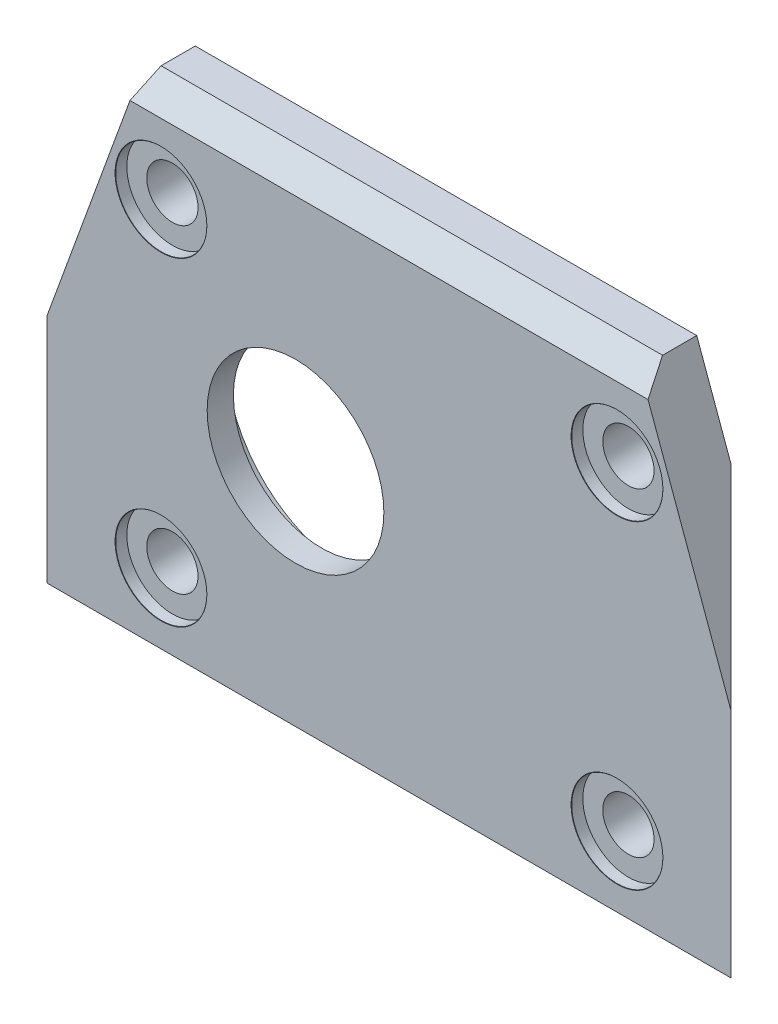
ISO-10303-21;
HEADER;
FILE_DESCRIPTION(('STEP AP214'),'2;1');
FILE_NAME('part.step','',(''),(''),'','','');
FILE_SCHEMA(('AUTOMOTIVE_DESIGN { 1 0 10303 214 1 1 1 1 }'));
ENDSEC;
DATA;
#1=APPLICATION_CONTEXT('core data for automotive mechanical design processes');
#2=APPLICATION_PROTOCOL_DEFINITION('international standard','automotive_design',2000,#1);
#3=PRODUCT_CONTEXT('',#1,'mechanical');
#4=PRODUCT('Part','Part','',(#3));
#5=PRODUCT_RELATED_PRODUCT_CATEGORY('part','',(#4));
#6=PRODUCT_DEFINITION_FORMATION('','',#4);
#7=PRODUCT_DEFINITION_CONTEXT('part definition',#1,'design');
#8=PRODUCT_DEFINITION('design','',#6,#7);
#9=PRODUCT_DEFINITION_SHAPE('','',#8);
#10=(LENGTH_UNIT() NAMED_UNIT(*) SI_UNIT(.MILLI.,.METRE.));
#11=(NAMED_UNIT(*) PLANE_ANGLE_UNIT() SI_UNIT($,.RADIAN.));
#12=(NAMED_UNIT(*) SI_UNIT($,.STERADIAN.) SOLID_ANGLE_UNIT());
#13=UNCERTAINTY_MEASURE_WITH_UNIT(LENGTH_MEASURE(1.E-05),#10,'distance_accuracy_value','');
#14=(GEOMETRIC_REPRESENTATION_CONTEXT(3) GLOBAL_UNCERTAINTY_ASSIGNED_CONTEXT((#13)) GLOBAL_UNIT_ASSIGNED_CONTEXT((#10,
#11,#12)) REPRESENTATION_CONTEXT('',''));
#15=CARTESIAN_POINT('',(0.,0.,0.));
#16=DIRECTION('',(0.,0.,1.));
#17=DIRECTION('',(1.,0.,0.));
#18=AXIS2_PLACEMENT_3D('',#15,#16,#17);
#19=CARTESIAN_POINT('',(-8.2,0.,5.));
#20=DIRECTION('',(0.,0.,-1.));
#21=DIRECTION('',(-1.,0.,0.));
#22=AXIS2_PLACEMENT_3D('',#19,#20,#21);
#23=CYLINDRICAL_SURFACE('',#22,7.75);
#24=CARTESIAN_POINT('',(-8.2,0.,5.));
#25=DIRECTION('',(0.,0.,1.));
#26=DIRECTION('',(1.,0.,0.));
#27=AXIS2_PLACEMENT_3D('',#24,#25,#26);
#28=CIRCLE('',#27,7.75);
#29=CARTESIAN_POINT('',(-0.450000000000001,0.,5.));
#30=VERTEX_POINT('',#29);
#31=EDGE_CURVE('E195',#30,#30,#28,.T.);
#32=ORIENTED_EDGE('',*,*,#31,.T.);
#33=EDGE_LOOP('',(#32));
#34=FACE_BOUND('',#33,.T.);
#35=CARTESIAN_POINT('',(-8.2,0.,2.7));
#36=DIRECTION('',(0.,0.,-1.));
#37=DIRECTION('',(-1.,0.,0.));
#38=AXIS2_PLACEMENT_3D('',#35,#36,#37);
#39=CIRCLE('',#38,7.75);
#40=CARTESIAN_POINT('',(-15.95,0.,2.7));
#41=VERTEX_POINT('',#40);
#42=EDGE_CURVE('E134',#41,#41,#39,.T.);
#43=ORIENTED_EDGE('',*,*,#42,.T.);
#44=EDGE_LOOP('',(#43));
#45=FACE_BOUND('',#44,.T.);
#46=ADVANCED_FACE('F37',(#34,#45),#23,.F.);
#47=CARTESIAN_POINT('',(-20.,14.,5.));
#48=DIRECTION('',(0.,0.,-1.));
#49=DIRECTION('',(-1.,0.,0.));
#50=AXIS2_PLACEMENT_3D('',#47,#48,#49);
#51=CYLINDRICAL_SURFACE('',#50,2.25);
#52=CARTESIAN_POINT('',(-20.,14.,0.));
#53=DIRECTION('',(0.,0.,1.));
#54=DIRECTION('',(1.,0.,0.));
#55=AXIS2_PLACEMENT_3D('',#52,#53,#54);
#56=CIRCLE('',#55,2.25);
#57=CARTESIAN_POINT('',(-17.75,14.,0.));
#58=VERTEX_POINT('',#57);
#59=EDGE_CURVE('E122',#58,#58,#56,.T.);
#60=ORIENTED_EDGE('',*,*,#59,.F.);
#61=EDGE_LOOP('',(#60));
#62=FACE_BOUND('',#61,.T.);
#63=CARTESIAN_POINT('',(-20.,14.,4.));
#64=DIRECTION('',(0.,0.,1.));
#65=DIRECTION('',(1.,0.,0.));
#66=AXIS2_PLACEMENT_3D('',#63,#64,#65);
#67=CIRCLE('',#66,2.25);
#68=CARTESIAN_POINT('',(-17.75,14.,4.));
#69=VERTEX_POINT('',#68);
#70=EDGE_CURVE('E234',#69,#69,#67,.T.);
#71=ORIENTED_EDGE('',*,*,#70,.T.);
#72=EDGE_LOOP('',(#71));
#73=FACE_BOUND('',#72,.T.);
#74=ADVANCED_FACE('F285',(#62,#73),#51,.F.);
#75=CARTESIAN_POINT('',(20.,14.,5.));
#76=DIRECTION('',(0.,0.,-1.));
#77=DIRECTION('',(-1.,0.,0.));
#78=AXIS2_PLACEMENT_3D('',#75,#76,#77);
#79=CYLINDRICAL_SURFACE('',#78,2.25);
#80=CARTESIAN_POINT('',(20.,14.,0.));
#81=DIRECTION('',(0.,0.,1.));
#82=DIRECTION('',(1.,0.,0.));
#83=AXIS2_PLACEMENT_3D('',#80,#81,#82);
#84=CIRCLE('',#83,2.25);
#85=CARTESIAN_POINT('',(22.25,14.,0.));
#86=VERTEX_POINT('',#85);
#87=EDGE_CURVE('E189',#86,#86,#84,.T.);
#88=ORIENTED_EDGE('',*,*,#87,.F.);
#89=EDGE_LOOP('',(#88));
#90=FACE_BOUND('',#89,.T.);
#91=CARTESIAN_POINT('',(20.,14.,4.));
#92=DIRECTION('',(0.,0.,1.));
#93=DIRECTION('',(1.,0.,0.));
#94=AXIS2_PLACEMENT_3D('',#91,#92,#93);
#95=CIRCLE('',#94,2.25);
#96=CARTESIAN_POINT('',(22.25,14.,4.));
#97=VERTEX_POINT('',#96);
#98=EDGE_CURVE('E222',#97,#97,#95,.T.);
#99=ORIENTED_EDGE('',*,*,#98,.T.);
#100=EDGE_LOOP('',(#99));
#101=FACE_BOUND('',#100,.T.);
#102=ADVANCED_FACE('F291',(#90,#101),#79,.F.);
#103=CARTESIAN_POINT('',(20.,-14.,5.));
#104=DIRECTION('',(0.,0.,-1.));
#105=DIRECTION('',(-1.,0.,0.));
#106=AXIS2_PLACEMENT_3D('',#103,#104,#105);
#107=CYLINDRICAL_SURFACE('',#106,2.25);
#108=CARTESIAN_POINT('',(20.,-14.,0.));
#109=DIRECTION('',(0.,0.,1.));
#110=DIRECTION('',(1.,0.,0.));
#111=AXIS2_PLACEMENT_3D('',#108,#109,#110);
#112=CIRCLE('',#111,2.25);
#113=CARTESIAN_POINT('',(22.25,-14.,0.));
#114=VERTEX_POINT('',#113);
#115=EDGE_CURVE('E192',#114,#114,#112,.T.);
#116=ORIENTED_EDGE('',*,*,#115,.F.);
#117=EDGE_LOOP('',(#116));
#118=FACE_BOUND('',#117,.T.);
#119=CARTESIAN_POINT('',(20.,-14.,4.));
#120=DIRECTION('',(0.,0.,1.));
#121=DIRECTION('',(1.,0.,0.));
#122=AXIS2_PLACEMENT_3D('',#119,#120,#121);
#123=CIRCLE('',#122,2.25);
#124=CARTESIAN_POINT('',(22.25,-14.,4.));
#125=VERTEX_POINT('',#124);
#126=EDGE_CURVE('E210',#125,#125,#123,.T.);
#127=ORIENTED_EDGE('',*,*,#126,.T.);
#128=EDGE_LOOP('',(#127));
#129=FACE_BOUND('',#128,.T.);
#130=ADVANCED_FACE('F296',(#118,#129),#107,.F.);
#131=CARTESIAN_POINT('',(0.,0.,5.));
#132=DIRECTION('',(0.,0.,-1.));
#133=DIRECTION('',(-1.,0.,0.));
#134=AXIS2_PLACEMENT_3D('',#131,#132,#133);
#135=PLANE('',#134);
#136=CARTESIAN_POINT('',(-20.,14.,5.));
#137=DIRECTION('',(0.,0.,1.));
#138=DIRECTION('',(1.,0.,0.));
#139=AXIS2_PLACEMENT_3D('',#136,#137,#138);
#140=CIRCLE('',#139,4.025);
#141=CARTESIAN_POINT('',(-15.975,14.,5.));
#142=VERTEX_POINT('',#141);
#143=EDGE_CURVE('E137',#142,#142,#140,.T.);
#144=ORIENTED_EDGE('',*,*,#143,.F.);
#145=EDGE_LOOP('',(#144));
#146=FACE_BOUND('',#145,.T.);
#147=CARTESIAN_POINT('',(20.,14.,5.));
#148=DIRECTION('',(0.,0.,1.));
#149=DIRECTION('',(1.,0.,0.));
#150=AXIS2_PLACEMENT_3D('',#147,#148,#149);
#151=CIRCLE('',#150,4.025);
#152=CARTESIAN_POINT('',(24.025,14.,5.));
#153=VERTEX_POINT('',#152);
#154=EDGE_CURVE('E231',#153,#153,#151,.T.);
#155=ORIENTED_EDGE('',*,*,#154,.F.);
#156=EDGE_LOOP('',(#155));
#157=FACE_BOUND('',#156,.T.);
#158=ORIENTED_EDGE('',*,*,#31,.F.);
#159=EDGE_LOOP('',(#158));
#160=FACE_BOUND('',#159,.T.);
#161=DIRECTION('',(0.,-1.,0.));
#162=VECTOR('',#161,1.);
#163=CARTESIAN_POINT('',(-30.,-22.15,5.));
#164=LINE('',#163,#162);
#165=CARTESIAN_POINT('',(-30.,0.149999999999786,5.));
#166=VERTEX_POINT('',#165);
#167=CARTESIAN_POINT('',(-30.,-20.15,5.));
#168=VERTEX_POINT('',#167);
#169=EDGE_CURVE('E131',#166,#168,#164,.T.);
#170=ORIENTED_EDGE('',*,*,#169,.T.);
#171=DIRECTION('',(1.,0.,0.));
#172=VECTOR('',#171,1.);
#173=CARTESIAN_POINT('',(0.,-20.15,5.));
#174=LINE('',#173,#172);
#175=CARTESIAN_POINT('',(30.,-20.15,5.));
#176=VERTEX_POINT('',#175);
#177=EDGE_CURVE('E149',#168,#176,#174,.T.);
#178=ORIENTED_EDGE('',*,*,#177,.T.);
#179=DIRECTION('',(0.,1.,0.));
#180=VECTOR('',#179,1.);
#181=CARTESIAN_POINT('',(30.,-22.15,5.));
#182=LINE('',#181,#180);
#183=CARTESIAN_POINT('',(30.,0.149999999999786,5.));
#184=VERTEX_POINT('',#183);
#185=EDGE_CURVE('E125',#176,#184,#182,.T.);
#186=ORIENTED_EDGE('',*,*,#185,.T.);
#187=DIRECTION('',(0.342020143325666,-0.939692620785909,0.));
#188=VECTOR('',#187,1.);
#189=CARTESIAN_POINT('',(21.9926548461435,22.15,5.));
#190=LINE('',#189,#188);
#191=CARTESIAN_POINT('',(22.7205953146759,20.15,5.));
#192=VERTEX_POINT('',#191);
#193=EDGE_CURVE('E143',#184,#192,#190,.F.);
#194=ORIENTED_EDGE('',*,*,#193,.T.);
#195=DIRECTION('',(-1.,0.,0.));
#196=VECTOR('',#195,1.);
#197=CARTESIAN_POINT('',(0.,20.15,5.));
#198=LINE('',#197,#196);
#199=CARTESIAN_POINT('',(-22.7205953146759,20.15,5.));
#200=VERTEX_POINT('',#199);
#201=EDGE_CURVE('E146',#192,#200,#198,.T.);
#202=ORIENTED_EDGE('',*,*,#201,.T.);
#203=DIRECTION('',(0.342020143325667,0.939692620785909,0.));
#204=VECTOR('',#203,1.);
#205=CARTESIAN_POINT('',(-30.,0.149999999999786,5.));
#206=LINE('',#205,#204);
#207=EDGE_CURVE('E117',#200,#166,#206,.F.);
#208=ORIENTED_EDGE('',*,*,#207,.T.);
#209=EDGE_LOOP('',(#170,#178,#186,#194,#202,#208));
#210=FACE_BOUND('',#209,.T.);
#211=CARTESIAN_POINT('',(-20.,-14.,5.));
#212=DIRECTION('',(0.,0.,1.));
#213=DIRECTION('',(1.,0.,0.));
#214=AXIS2_PLACEMENT_3D('',#211,#212,#213);
#215=CIRCLE('',#214,4.025);
#216=CARTESIAN_POINT('',(-15.975,-14.,5.));
#217=VERTEX_POINT('',#216);
#218=EDGE_CURVE('E207',#217,#217,#215,.T.);
#219=ORIENTED_EDGE('',*,*,#218,.F.);
#220=EDGE_LOOP('',(#219));
#221=FACE_BOUND('',#220,.T.);
#222=CARTESIAN_POINT('',(20.,-14.,5.));
#223=DIRECTION('',(0.,0.,1.));
#224=DIRECTION('',(1.,0.,0.));
#225=AXIS2_PLACEMENT_3D('',#222,#223,#224);
#226=CIRCLE('',#225,4.025);
#227=CARTESIAN_POINT('',(24.025,-14.,5.));
#228=VERTEX_POINT('',#227);
#229=EDGE_CURVE('E219',#228,#228,#226,.T.);
#230=ORIENTED_EDGE('',*,*,#229,.F.);
#231=EDGE_LOOP('',(#230));
#232=FACE_BOUND('',#231,.T.);
#233=ADVANCED_FACE('F178',(#146,#157,#160,#210,#221,#232),#135,.F.);
#234=CARTESIAN_POINT('',(0.,0.,0.));
#235=DIRECTION('',(0.,0.,-1.));
#236=DIRECTION('',(-1.,0.,0.));
#237=AXIS2_PLACEMENT_3D('',#234,#235,#236);
#238=PLANE('',#237);
#239=CARTESIAN_POINT('',(-8.2,0.,0.));
#240=DIRECTION('',(0.,0.,-1.));
#241=DIRECTION('',(-1.,0.,0.));
#242=AXIS2_PLACEMENT_3D('',#239,#240,#241);
#243=CIRCLE('',#242,11.1);
#244=CARTESIAN_POINT('',(-19.3,0.,0.));
#245=VERTEX_POINT('',#244);
#246=EDGE_CURVE('E245',#245,#245,#243,.T.);
#247=ORIENTED_EDGE('',*,*,#246,.F.);
#248=EDGE_LOOP('',(#247));
#249=FACE_BOUND('',#248,.T.);
#250=ORIENTED_EDGE('',*,*,#115,.T.);
#251=EDGE_LOOP('',(#250));
#252=FACE_BOUND('',#251,.T.);
#253=CARTESIAN_POINT('',(-20.,-14.,0.));
#254=DIRECTION('',(0.,0.,1.));
#255=DIRECTION('',(1.,0.,0.));
#256=AXIS2_PLACEMENT_3D('',#253,#254,#255);
#257=CIRCLE('',#256,2.25);
#258=CARTESIAN_POINT('',(-17.75,-14.,0.));
#259=VERTEX_POINT('',#258);
#260=EDGE_CURVE('E128',#259,#259,#257,.T.);
#261=ORIENTED_EDGE('',*,*,#260,.T.);
#262=EDGE_LOOP('',(#261));
#263=FACE_BOUND('',#262,.T.);
#264=DIRECTION('',(1.,0.,0.));
#265=VECTOR('',#264,1.);
#266=CARTESIAN_POINT('',(-30.,-22.15,0.));
#267=LINE('',#266,#265);
#268=CARTESIAN_POINT('',(-25.,-22.15,0.));
#269=VERTEX_POINT('',#268);
#270=CARTESIAN_POINT('',(25.,-22.15,0.));
#271=VERTEX_POINT('',#270);
#272=EDGE_CURVE('E121',#269,#271,#267,.T.);
#273=ORIENTED_EDGE('',*,*,#272,.F.);
#274=DIRECTION('',(0.,1.,0.));
#275=VECTOR('',#274,1.);
#276=CARTESIAN_POINT('',(-25.,0.149999999999786,0.));
#277=LINE('',#276,#275);
#278=CARTESIAN_POINT('',(-25.,13.887387097273,0.));
#279=VERTEX_POINT('',#278);
#280=EDGE_CURVE('E52',#269,#279,#277,.T.);
#281=ORIENTED_EDGE('',*,*,#280,.T.);
#282=DIRECTION('',(-0.342020143325667,-0.939692620785909,0.));
#283=VECTOR('',#282,1.);
#284=CARTESIAN_POINT('',(-26.5388757175111,9.65936081206409,0.));
#285=LINE('',#284,#283);
#286=CARTESIAN_POINT('',(-21.9926548461435,22.15,0.));
#287=VERTEX_POINT('',#286);
#288=EDGE_CURVE('E111',#279,#287,#285,.F.);
#289=ORIENTED_EDGE('',*,*,#288,.T.);
#290=DIRECTION('',(-1.,0.,0.));
#291=VECTOR('',#290,1.);
#292=CARTESIAN_POINT('',(-30.,22.15,0.));
#293=LINE('',#292,#291);
#294=CARTESIAN_POINT('',(21.9926548461435,22.15,0.));
#295=VERTEX_POINT('',#294);
#296=EDGE_CURVE('E106',#295,#287,#293,.T.);
#297=ORIENTED_EDGE('',*,*,#296,.F.);
#298=DIRECTION('',(-0.342020143325666,0.939692620785909,0.));
#299=VECTOR('',#298,1.);
#300=CARTESIAN_POINT('',(26.5388757175111,9.65936081206408,0.));
#301=LINE('',#300,#299);
#302=CARTESIAN_POINT('',(25.,13.887387097273,0.));
#303=VERTEX_POINT('',#302);
#304=EDGE_CURVE('E114',#295,#303,#301,.F.);
#305=ORIENTED_EDGE('',*,*,#304,.T.);
#306=DIRECTION('',(0.,-1.,0.));
#307=VECTOR('',#306,1.);
#308=CARTESIAN_POINT('',(25.,-22.15,0.));
#309=LINE('',#308,#307);
#310=EDGE_CURVE('E168',#303,#271,#309,.T.);
#311=ORIENTED_EDGE('',*,*,#310,.T.);
#312=EDGE_LOOP('',(#273,#281,#289,#297,#305,#311));
#313=FACE_BOUND('',#312,.T.);
#314=ORIENTED_EDGE('',*,*,#59,.T.);
#315=EDGE_LOOP('',(#314));
#316=FACE_BOUND('',#315,.T.);
#317=ORIENTED_EDGE('',*,*,#87,.T.);
#318=EDGE_LOOP('',(#317));
#319=FACE_BOUND('',#318,.T.);
#320=ADVANCED_FACE('F119',(#249,#252,#263,#313,#316,#319),#238,.T.);
#321=CARTESIAN_POINT('',(-30.,22.15,5.));
#322=DIRECTION('',(0.,-1.,0.));
#323=DIRECTION('',(0.,0.,-1.));
#324=AXIS2_PLACEMENT_3D('',#321,#322,#323);
#325=PLANE('',#324);
#326=DIRECTION('',(0.,0.,1.));
#327=VECTOR('',#326,1.);
#328=CARTESIAN_POINT('',(-21.9926548461435,22.15,5.));
#329=LINE('',#328,#327);
#330=CARTESIAN_POINT('',(-21.9926548461435,22.15,2.99999999999999));
#331=VERTEX_POINT('',#330);
#332=EDGE_CURVE('E112',#287,#331,#329,.T.);
#333=ORIENTED_EDGE('',*,*,#332,.T.);
#334=DIRECTION('',(1.,0.,0.));
#335=VECTOR('',#334,1.);
#336=CARTESIAN_POINT('',(-30.,22.15,2.99999999999999));
#337=LINE('',#336,#335);
#338=CARTESIAN_POINT('',(21.9926548461435,22.15,2.99999999999999));
#339=VERTEX_POINT('',#338);
#340=EDGE_CURVE('E109',#331,#339,#337,.T.);
#341=ORIENTED_EDGE('',*,*,#340,.T.);
#342=DIRECTION('',(0.,0.,-1.));
#343=VECTOR('',#342,1.);
#344=CARTESIAN_POINT('',(21.9926548461435,22.15,5.));
#345=LINE('',#344,#343);
#346=EDGE_CURVE('E102',#339,#295,#345,.T.);
#347=ORIENTED_EDGE('',*,*,#346,.T.);
#348=ORIENTED_EDGE('',*,*,#296,.T.);
#349=EDGE_LOOP('',(#333,#341,#347,#348));
#350=FACE_BOUND('',#349,.T.);
#351=ADVANCED_FACE('F104',(#350),#325,.F.);
#352=CARTESIAN_POINT('',(-30.,-22.15,5.));
#353=DIRECTION('',(0.,1.,0.));
#354=DIRECTION('',(0.,0.,1.));
#355=AXIS2_PLACEMENT_3D('',#352,#353,#354);
#356=PLANE('',#355);
#357=DIRECTION('',(-1.,0.,0.));
#358=VECTOR('',#357,1.);
#359=CARTESIAN_POINT('',(-30.,-22.15,2.99999999999999));
#360=LINE('',#359,#358);
#361=CARTESIAN_POINT('',(28.,-22.15,2.99999999999999));
#362=VERTEX_POINT('',#361);
#363=CARTESIAN_POINT('',(-28.,-22.15,2.99999999999999));
#364=VERTEX_POINT('',#363);
#365=EDGE_CURVE('E152',#362,#364,#360,.T.);
#366=ORIENTED_EDGE('',*,*,#365,.T.);
#367=DIRECTION('',(0.707106781186548,0.,-0.707106781186547));
#368=VECTOR('',#367,1.);
#369=CARTESIAN_POINT('',(-30.,-22.15,5.));
#370=LINE('',#369,#368);
#371=EDGE_CURVE('E166',#364,#269,#370,.T.);
#372=ORIENTED_EDGE('',*,*,#371,.T.);
#373=ORIENTED_EDGE('',*,*,#272,.T.);
#374=DIRECTION('',(0.707106781186548,0.,0.707106781186547));
#375=VECTOR('',#374,1.);
#376=CARTESIAN_POINT('',(30.,-22.15,5.));
#377=LINE('',#376,#375);
#378=EDGE_CURVE('E164',#271,#362,#377,.T.);
#379=ORIENTED_EDGE('',*,*,#378,.T.);
#380=EDGE_LOOP('',(#366,#372,#373,#379));
#381=FACE_BOUND('',#380,.T.);
#382=ADVANCED_FACE('F270',(#381),#356,.F.);
#383=CARTESIAN_POINT('',(-20.,-14.,5.));
#384=DIRECTION('',(0.,0.,-1.));
#385=DIRECTION('',(-1.,0.,0.));
#386=AXIS2_PLACEMENT_3D('',#383,#384,#385);
#387=CYLINDRICAL_SURFACE('',#386,2.25);
#388=CARTESIAN_POINT('',(-20.,-14.,4.));
#389=DIRECTION('',(0.,0.,1.));
#390=DIRECTION('',(1.,0.,0.));
#391=AXIS2_PLACEMENT_3D('',#388,#389,#390);
#392=CIRCLE('',#391,2.25);
#393=CARTESIAN_POINT('',(-17.75,-14.,4.));
#394=VERTEX_POINT('',#393);
#395=EDGE_CURVE('E198',#394,#394,#392,.T.);
#396=ORIENTED_EDGE('',*,*,#395,.T.);
#397=EDGE_LOOP('',(#396));
#398=FACE_BOUND('',#397,.T.);
#399=ORIENTED_EDGE('',*,*,#260,.F.);
#400=EDGE_LOOP('',(#399));
#401=FACE_BOUND('',#400,.T.);
#402=ADVANCED_FACE('F267',(#398,#401),#387,.F.);
#403=CARTESIAN_POINT('',(-16.,-14.,4.));
#404=DIRECTION('',(0.,0.,-1.));
#405=DIRECTION('',(-1.,0.,0.));
#406=AXIS2_PLACEMENT_3D('',#403,#404,#405);
#407=PLANE('',#406);
#408=ORIENTED_EDGE('',*,*,#395,.F.);
#409=EDGE_LOOP('',(#408));
#410=FACE_BOUND('',#409,.T.);
#411=CARTESIAN_POINT('',(-20.,-14.,4.));
#412=DIRECTION('',(0.,0.,1.));
#413=DIRECTION('',(1.,0.,0.));
#414=AXIS2_PLACEMENT_3D('',#411,#412,#413);
#415=CIRCLE('',#414,4.);
#416=CARTESIAN_POINT('',(-16.,-14.,4.));
#417=VERTEX_POINT('',#416);
#418=EDGE_CURVE('E201',#417,#417,#415,.T.);
#419=ORIENTED_EDGE('',*,*,#418,.T.);
#420=EDGE_LOOP('',(#419));
#421=FACE_BOUND('',#420,.T.);
#422=ADVANCED_FACE('F269',(#410,#421),#407,.F.);
#423=CARTESIAN_POINT('',(-20.,-14.,5.));
#424=DIRECTION('',(0.,0.,1.));
#425=DIRECTION('',(1.,0.,0.));
#426=AXIS2_PLACEMENT_3D('',#423,#424,#425);
#427=CYLINDRICAL_SURFACE('',#426,4.);
#428=ORIENTED_EDGE('',*,*,#418,.F.);
#429=EDGE_LOOP('',(#428));
#430=FACE_BOUND('',#429,.T.);
#431=CARTESIAN_POINT('',(-20.,-14.,4.975));
#432=DIRECTION('',(0.,0.,1.));
#433=DIRECTION('',(1.,0.,0.));
#434=AXIS2_PLACEMENT_3D('',#431,#432,#433);
#435=CIRCLE('',#434,4.);
#436=CARTESIAN_POINT('',(-16.,-14.,4.975));
#437=VERTEX_POINT('',#436);
#438=EDGE_CURVE('E204',#437,#437,#435,.T.);
#439=ORIENTED_EDGE('',*,*,#438,.T.);
#440=EDGE_LOOP('',(#439));
#441=FACE_BOUND('',#440,.T.);
#442=ADVANCED_FACE('F277',(#430,#441),#427,.F.);
#443=CARTESIAN_POINT('',(-20.,-14.,5.));
#444=DIRECTION('',(0.,0.,1.));
#445=DIRECTION('',(1.,0.,0.));
#446=AXIS2_PLACEMENT_3D('',#443,#444,#445);
#447=CONICAL_SURFACE('',#446,4.025,0.785398163397431);
#448=ORIENTED_EDGE('',*,*,#438,.F.);
#449=EDGE_LOOP('',(#448));
#450=FACE_BOUND('',#449,.T.);
#451=ORIENTED_EDGE('',*,*,#218,.T.);
#452=EDGE_LOOP('',(#451));
#453=FACE_BOUND('',#452,.T.);
#454=ADVANCED_FACE('F505',(#450,#453),#447,.F.);
#455=CARTESIAN_POINT('',(24.,-14.,4.));
#456=DIRECTION('',(0.,0.,-1.));
#457=DIRECTION('',(-1.,0.,0.));
#458=AXIS2_PLACEMENT_3D('',#455,#456,#457);
#459=PLANE('',#458);
#460=ORIENTED_EDGE('',*,*,#126,.F.);
#461=EDGE_LOOP('',(#460));
#462=FACE_BOUND('',#461,.T.);
#463=CARTESIAN_POINT('',(20.,-14.,4.));
#464=DIRECTION('',(0.,0.,1.));
#465=DIRECTION('',(1.,0.,0.));
#466=AXIS2_PLACEMENT_3D('',#463,#464,#465);
#467=CIRCLE('',#466,4.);
#468=CARTESIAN_POINT('',(24.,-14.,4.));
#469=VERTEX_POINT('',#468);
#470=EDGE_CURVE('E213',#469,#469,#467,.T.);
#471=ORIENTED_EDGE('',*,*,#470,.T.);
#472=EDGE_LOOP('',(#471));
#473=FACE_BOUND('',#472,.T.);
#474=ADVANCED_FACE('F495',(#462,#473),#459,.F.);
#475=CARTESIAN_POINT('',(20.,-14.,5.));
#476=DIRECTION('',(0.,0.,1.));
#477=DIRECTION('',(1.,0.,0.));
#478=AXIS2_PLACEMENT_3D('',#475,#476,#477);
#479=CYLINDRICAL_SURFACE('',#478,4.);
#480=ORIENTED_EDGE('',*,*,#470,.F.);
#481=EDGE_LOOP('',(#480));
#482=FACE_BOUND('',#481,.T.);
#483=CARTESIAN_POINT('',(20.,-14.,4.975));
#484=DIRECTION('',(0.,0.,1.));
#485=DIRECTION('',(1.,0.,0.));
#486=AXIS2_PLACEMENT_3D('',#483,#484,#485);
#487=CIRCLE('',#486,4.);
#488=CARTESIAN_POINT('',(24.,-14.,4.975));
#489=VERTEX_POINT('',#488);
#490=EDGE_CURVE('E216',#489,#489,#487,.T.);
#491=ORIENTED_EDGE('',*,*,#490,.T.);
#492=EDGE_LOOP('',(#491));
#493=FACE_BOUND('',#492,.T.);
#494=ADVANCED_FACE('F485',(#482,#493),#479,.F.);
#495=CARTESIAN_POINT('',(20.,-14.,5.));
#496=DIRECTION('',(0.,0.,1.));
#497=DIRECTION('',(1.,0.,0.));
#498=AXIS2_PLACEMENT_3D('',#495,#496,#497);
#499=CONICAL_SURFACE('',#498,4.025,0.785398163397431);
#500=ORIENTED_EDGE('',*,*,#490,.F.);
#501=EDGE_LOOP('',(#500));
#502=FACE_BOUND('',#501,.T.);
#503=ORIENTED_EDGE('',*,*,#229,.T.);
#504=EDGE_LOOP('',(#503));
#505=FACE_BOUND('',#504,.T.);
#506=ADVANCED_FACE('F311',(#502,#505),#499,.F.);
#507=CARTESIAN_POINT('',(24.,14.,4.));
#508=DIRECTION('',(0.,0.,-1.));
#509=DIRECTION('',(-1.,0.,0.));
#510=AXIS2_PLACEMENT_3D('',#507,#508,#509);
#511=PLANE('',#510);
#512=ORIENTED_EDGE('',*,*,#98,.F.);
#513=EDGE_LOOP('',(#512));
#514=FACE_BOUND('',#513,.T.);
#515=CARTESIAN_POINT('',(20.,14.,4.));
#516=DIRECTION('',(0.,0.,1.));
#517=DIRECTION('',(1.,0.,0.));
#518=AXIS2_PLACEMENT_3D('',#515,#516,#517);
#519=CIRCLE('',#518,4.);
#520=CARTESIAN_POINT('',(24.,14.,4.));
#521=VERTEX_POINT('',#520);
#522=EDGE_CURVE('E225',#521,#521,#519,.T.);
#523=ORIENTED_EDGE('',*,*,#522,.T.);
#524=EDGE_LOOP('',(#523));
#525=FACE_BOUND('',#524,.T.);
#526=ADVANCED_FACE('F307',(#514,#525),#511,.F.);
#527=CARTESIAN_POINT('',(20.,14.,5.));
#528=DIRECTION('',(0.,0.,1.));
#529=DIRECTION('',(1.,0.,0.));
#530=AXIS2_PLACEMENT_3D('',#527,#528,#529);
#531=CYLINDRICAL_SURFACE('',#530,4.);
#532=ORIENTED_EDGE('',*,*,#522,.F.);
#533=EDGE_LOOP('',(#532));
#534=FACE_BOUND('',#533,.T.);
#535=CARTESIAN_POINT('',(20.,14.,4.975));
#536=DIRECTION('',(0.,0.,1.));
#537=DIRECTION('',(1.,0.,0.));
#538=AXIS2_PLACEMENT_3D('',#535,#536,#537);
#539=CIRCLE('',#538,4.);
#540=CARTESIAN_POINT('',(24.,14.,4.975));
#541=VERTEX_POINT('',#540);
#542=EDGE_CURVE('E228',#541,#541,#539,.T.);
#543=ORIENTED_EDGE('',*,*,#542,.T.);
#544=EDGE_LOOP('',(#543));
#545=FACE_BOUND('',#544,.T.);
#546=ADVANCED_FACE('F310',(#534,#545),#531,.F.);
#547=CARTESIAN_POINT('',(20.,14.,5.));
#548=DIRECTION('',(0.,0.,1.));
#549=DIRECTION('',(1.,0.,0.));
#550=AXIS2_PLACEMENT_3D('',#547,#548,#549);
#551=CONICAL_SURFACE('',#550,4.025,0.785398163397431);
#552=ORIENTED_EDGE('',*,*,#542,.F.);
#553=EDGE_LOOP('',(#552));
#554=FACE_BOUND('',#553,.T.);
#555=ORIENTED_EDGE('',*,*,#154,.T.);
#556=EDGE_LOOP('',(#555));
#557=FACE_BOUND('',#556,.T.);
#558=ADVANCED_FACE('F317',(#554,#557),#551,.F.);
#559=CARTESIAN_POINT('',(-16.,14.,4.));
#560=DIRECTION('',(0.,0.,-1.));
#561=DIRECTION('',(-1.,0.,0.));
#562=AXIS2_PLACEMENT_3D('',#559,#560,#561);
#563=PLANE('',#562);
#564=ORIENTED_EDGE('',*,*,#70,.F.);
#565=EDGE_LOOP('',(#564));
#566=FACE_BOUND('',#565,.T.);
#567=CARTESIAN_POINT('',(-20.,14.,4.));
#568=DIRECTION('',(0.,0.,1.));
#569=DIRECTION('',(1.,0.,0.));
#570=AXIS2_PLACEMENT_3D('',#567,#568,#569);
#571=CIRCLE('',#570,4.);
#572=CARTESIAN_POINT('',(-16.,14.,4.));
#573=VERTEX_POINT('',#572);
#574=EDGE_CURVE('E237',#573,#573,#571,.T.);
#575=ORIENTED_EDGE('',*,*,#574,.T.);
#576=EDGE_LOOP('',(#575));
#577=FACE_BOUND('',#576,.T.);
#578=ADVANCED_FACE('F323',(#566,#577),#563,.F.);
#579=CARTESIAN_POINT('',(-20.,14.,5.));
#580=DIRECTION('',(0.,0.,1.));
#581=DIRECTION('',(1.,0.,0.));
#582=AXIS2_PLACEMENT_3D('',#579,#580,#581);
#583=CYLINDRICAL_SURFACE('',#582,4.);
#584=ORIENTED_EDGE('',*,*,#574,.F.);
#585=EDGE_LOOP('',(#584));
#586=FACE_BOUND('',#585,.T.);
#587=CARTESIAN_POINT('',(-20.,14.,4.975));
#588=DIRECTION('',(0.,0.,1.));
#589=DIRECTION('',(1.,0.,0.));
#590=AXIS2_PLACEMENT_3D('',#587,#588,#589);
#591=CIRCLE('',#590,4.);
#592=CARTESIAN_POINT('',(-16.,14.,4.975));
#593=VERTEX_POINT('',#592);
#594=EDGE_CURVE('E240',#593,#593,#591,.T.);
#595=ORIENTED_EDGE('',*,*,#594,.T.);
#596=EDGE_LOOP('',(#595));
#597=FACE_BOUND('',#596,.T.);
#598=ADVANCED_FACE('F439',(#586,#597),#583,.F.);
#599=CARTESIAN_POINT('',(-20.,14.,5.));
#600=DIRECTION('',(0.,0.,1.));
#601=DIRECTION('',(1.,0.,0.));
#602=AXIS2_PLACEMENT_3D('',#599,#600,#601);
#603=CONICAL_SURFACE('',#602,4.025,0.785398163397431);
#604=ORIENTED_EDGE('',*,*,#594,.F.);
#605=EDGE_LOOP('',(#604));
#606=FACE_BOUND('',#605,.T.);
#607=ORIENTED_EDGE('',*,*,#143,.T.);
#608=EDGE_LOOP('',(#607));
#609=FACE_BOUND('',#608,.T.);
#610=ADVANCED_FACE('F256',(#606,#609),#603,.F.);
#611=CARTESIAN_POINT('',(-8.2,0.,2.7));
#612=DIRECTION('',(0.,0.,-1.));
#613=DIRECTION('',(-1.,0.,0.));
#614=AXIS2_PLACEMENT_3D('',#611,#612,#613);
#615=CYLINDRICAL_SURFACE('',#614,11.1);
#616=CARTESIAN_POINT('',(-8.2,0.,2.7));
#617=DIRECTION('',(0.,0.,-1.));
#618=DIRECTION('',(-1.,0.,0.));
#619=AXIS2_PLACEMENT_3D('',#616,#617,#618);
#620=CIRCLE('',#619,11.1);
#621=CARTESIAN_POINT('',(-19.3,0.,2.7));
#622=VERTEX_POINT('',#621);
#623=EDGE_CURVE('E138',#622,#622,#620,.T.);
#624=CARTESIAN_POINT('',(-19.3,0.,2.7));
#625=CARTESIAN_POINT('',(-19.3,0.,2.671875));
#626=CARTESIAN_POINT('',(-19.3,0.,2.64375));
#627=CARTESIAN_POINT('',(-19.3,0.,2.5875));
#628=CARTESIAN_POINT('',(-19.3,0.,2.559375));
#629=CARTESIAN_POINT('',(-19.3,0.,2.503125));
#630=CARTESIAN_POINT('',(-19.3,0.,2.475));
#631=CARTESIAN_POINT('',(-19.3,0.,2.41875));
#632=CARTESIAN_POINT('',(-19.3,0.,2.390625));
#633=CARTESIAN_POINT('',(-19.3,0.,2.334375));
#634=CARTESIAN_POINT('',(-19.3,0.,2.30625));
#635=CARTESIAN_POINT('',(-19.3,0.,2.25));
#636=CARTESIAN_POINT('',(-19.3,0.,2.221875));
#637=CARTESIAN_POINT('',(-19.3,0.,2.165625));
#638=CARTESIAN_POINT('',(-19.3,0.,2.1375));
#639=CARTESIAN_POINT('',(-19.3,0.,2.08125));
#640=CARTESIAN_POINT('',(-19.3,0.,2.053125));
#641=CARTESIAN_POINT('',(-19.3,0.,1.996875));
#642=CARTESIAN_POINT('',(-19.3,0.,1.96875));
#643=CARTESIAN_POINT('',(-19.3,0.,1.9125));
#644=CARTESIAN_POINT('',(-19.3,0.,1.884375));
#645=CARTESIAN_POINT('',(-19.3,0.,1.828125));
#646=CARTESIAN_POINT('',(-19.3,0.,1.8));
#647=CARTESIAN_POINT('',(-19.3,0.,1.74375));
#648=CARTESIAN_POINT('',(-19.3,0.,1.715625));
#649=CARTESIAN_POINT('',(-19.3,0.,1.659375));
#650=CARTESIAN_POINT('',(-19.3,0.,1.63125));
#651=CARTESIAN_POINT('',(-19.3,0.,1.575));
#652=CARTESIAN_POINT('',(-19.3,0.,1.546875));
#653=CARTESIAN_POINT('',(-19.3,0.,1.490625));
#654=CARTESIAN_POINT('',(-19.3,0.,1.4625));
#655=CARTESIAN_POINT('',(-19.3,0.,1.40625));
#656=CARTESIAN_POINT('',(-19.3,0.,1.378125));
#657=CARTESIAN_POINT('',(-19.3,0.,1.321875));
#658=CARTESIAN_POINT('',(-19.3,0.,1.29375));
#659=CARTESIAN_POINT('',(-19.3,0.,1.2375));
#660=CARTESIAN_POINT('',(-19.3,0.,1.209375));
#661=CARTESIAN_POINT('',(-19.3,0.,1.153125));
#662=CARTESIAN_POINT('',(-19.3,0.,1.125));
#663=CARTESIAN_POINT('',(-19.3,0.,1.06875));
#664=CARTESIAN_POINT('',(-19.3,0.,1.040625));
#665=CARTESIAN_POINT('',(-19.3,0.,0.984375));
#666=CARTESIAN_POINT('',(-19.3,0.,0.95625));
#667=CARTESIAN_POINT('',(-19.3,0.,0.9));
#668=CARTESIAN_POINT('',(-19.3,0.,0.871875));
#669=CARTESIAN_POINT('',(-19.3,0.,0.815625));
#670=CARTESIAN_POINT('',(-19.3,0.,0.7875));
#671=CARTESIAN_POINT('',(-19.3,0.,0.73125));
#672=CARTESIAN_POINT('',(-19.3,0.,0.703125000000001));
#673=CARTESIAN_POINT('',(-19.3,0.,0.646875000000001));
#674=CARTESIAN_POINT('',(-19.3,0.,0.61875));
#675=CARTESIAN_POINT('',(-19.3,0.,0.5625));
#676=CARTESIAN_POINT('',(-19.3,0.,0.534375000000001));
#677=CARTESIAN_POINT('',(-19.3,0.,0.478125000000001));
#678=CARTESIAN_POINT('',(-19.3,0.,0.45));
#679=CARTESIAN_POINT('',(-19.3,0.,0.39375));
#680=CARTESIAN_POINT('',(-19.3,0.,0.365625));
#681=CARTESIAN_POINT('',(-19.3,0.,0.309375));
#682=CARTESIAN_POINT('',(-19.3,0.,0.28125));
#683=CARTESIAN_POINT('',(-19.3,0.,0.225));
#684=CARTESIAN_POINT('',(-19.3,0.,0.196875));
#685=CARTESIAN_POINT('',(-19.3,0.,0.140625));
#686=CARTESIAN_POINT('',(-19.3,0.,0.1125));
#687=CARTESIAN_POINT('',(-19.3,0.,0.0562500000000003));
#688=CARTESIAN_POINT('',(-19.3,0.,0.0281250000000003));
#689=CARTESIAN_POINT('',(-19.3,0.,0.));
#690=B_SPLINE_CURVE_WITH_KNOTS('',3,(#624,#625,#626,#627,#628,#629,#630,#631,#632,#633,#634,
#635,#636,#637,#638,#639,#640,#641,#642,#643,#644,#645,#646,#647,#648,#649,#650,#651,#652,#653,
#654,#655,#656,#657,#658,#659,#660,#661,#662,#663,#664,#665,#666,#667,#668,#669,#670,#671,#672,
#673,#674,#675,#676,#677,#678,#679,#680,#681,#682,#683,#684,#685,#686,#687,#688,#689),
.UNSPECIFIED.,.F.,.F.,(4,2,2,2,2,2,2,2,2,2,2,2,2,2,2,2,2,2,2,2,2,2,2,2,2,2,2,2,2,2,2,2,4),(0.,
0.0843750000000003,0.16875,0.253125,0.3375,0.421875,0.50625,0.590625,0.675,0.759375,0.84375,
0.928125,1.0125,1.096875,1.18125,1.265625,1.35,1.434375,1.51875,1.603125,1.6875,1.771875,
1.85625,1.940625,2.025,2.109375,2.19375,2.278125,2.3625,2.446875,2.53125,2.615625,2.7),.UNSPECIFIED.);
#691=EDGE_CURVE('BSEAM253',#622,#245,#690,.T.);
#692=ORIENTED_EDGE('',*,*,#623,.F.);
#693=ORIENTED_EDGE('',*,*,#246,.T.);
#694=ORIENTED_EDGE('',*,*,#691,.T.);
#695=ORIENTED_EDGE('',*,*,#691,.F.);
#696=EDGE_LOOP('',(#692,#694,#693,#695));
#697=FACE_BOUND('',#696,.T.);
#698=ADVANCED_FACE('F253',(#697),#615,.F.);
#699=CARTESIAN_POINT('',(-8.2,0.,2.7));
#700=DIRECTION('',(0.,0.,-1.));
#701=DIRECTION('',(-1.,0.,0.));
#702=AXIS2_PLACEMENT_3D('',#699,#700,#701);
#703=PLANE('',#702);
#704=ORIENTED_EDGE('',*,*,#42,.F.);
#705=EDGE_LOOP('',(#704));
#706=FACE_BOUND('',#705,.T.);
#707=ORIENTED_EDGE('',*,*,#623,.T.);
#708=EDGE_LOOP('',(#707));
#709=FACE_BOUND('',#708,.T.);
#710=ADVANCED_FACE('F251',(#706,#709),#703,.T.);
#711=CARTESIAN_POINT('',(21.9926548461435,22.15,5.));
#712=DIRECTION('',(-0.939692620785909,-0.342020143325666,0.));
#713=DIRECTION('',(0.,0.,-1.));
#714=AXIS2_PLACEMENT_3D('',#711,#712,#713);
#715=PLANE('',#714);
#716=ORIENTED_EDGE('',*,*,#193,.F.);
#717=DIRECTION('',(0.323615577118183,-0.88912649071599,0.323615577118182));
#718=VECTOR('',#717,1.);
#719=CARTESIAN_POINT('',(22.8312404164064,19.8460050814222,-2.16875958359358));
#720=LINE('',#719,#718);
#721=EDGE_CURVE('E11',#184,#303,#720,.F.);
#722=ORIENTED_EDGE('',*,*,#721,.T.);
#723=ORIENTED_EDGE('',*,*,#304,.F.);
#724=ORIENTED_EDGE('',*,*,#346,.F.);
#725=DIRECTION('',(0.249243569363952,-0.684791078771734,0.684791078771739));
#726=VECTOR('',#725,1.);
#727=CARTESIAN_POINT('',(22.3340143916269,21.2121223568693,3.93787764313072));
#728=LINE('',#727,#726);
#729=EDGE_CURVE('E158',#339,#192,#728,.T.);
#730=ORIENTED_EDGE('',*,*,#729,.T.);
#731=EDGE_LOOP('',(#716,#722,#723,#724,#730));
#732=FACE_BOUND('',#731,.T.);
#733=ADVANCED_FACE('F115',(#732),#715,.F.);
#734=CARTESIAN_POINT('',(-30.,0.149999999999786,5.));
#735=DIRECTION('',(0.939692620785909,-0.342020143325667,0.));
#736=DIRECTION('',(0.,0.,-1.));
#737=AXIS2_PLACEMENT_3D('',#734,#735,#736);
#738=PLANE('',#737);
#739=ORIENTED_EDGE('',*,*,#288,.F.);
#740=DIRECTION('',(0.323615577118183,0.88912649071599,-0.323615577118183));
#741=VECTOR('',#740,1.);
#742=CARTESIAN_POINT('',(-30.,0.149999999999786,5.));
#743=LINE('',#742,#741);
#744=EDGE_CURVE('E45',#279,#166,#743,.F.);
#745=ORIENTED_EDGE('',*,*,#744,.T.);
#746=ORIENTED_EDGE('',*,*,#207,.F.);
#747=DIRECTION('',(0.249243569363952,0.684791078771734,-0.684791078771739));
#748=VECTOR('',#747,1.);
#749=CARTESIAN_POINT('',(-26.5864045451668,9.52877643130712,15.621223568693));
#750=LINE('',#749,#748);
#751=EDGE_CURVE('E155',#200,#331,#750,.T.);
#752=ORIENTED_EDGE('',*,*,#751,.T.);
#753=ORIENTED_EDGE('',*,*,#332,.F.);
#754=EDGE_LOOP('',(#739,#745,#746,#752,#753));
#755=FACE_BOUND('',#754,.T.);
#756=ADVANCED_FACE('F173',(#755),#738,.F.);
#757=CARTESIAN_POINT('',(0.,-20.15,5.));
#758=DIRECTION('',(0.,0.70710678118655,-0.707106781186545));
#759=DIRECTION('',(1.,0.,0.));
#760=AXIS2_PLACEMENT_3D('',#757,#758,#759);
#761=PLANE('',#760);
#762=ORIENTED_EDGE('',*,*,#177,.F.);
#763=DIRECTION('',(-0.577350269189628,0.577350269189623,0.577350269189627));
#764=VECTOR('',#763,1.);
#765=CARTESIAN_POINT('',(-19.9999999999999,-30.15,-5.00000000000005));
#766=LINE('',#765,#764);
#767=EDGE_CURVE('E162',#168,#364,#766,.F.);
#768=ORIENTED_EDGE('',*,*,#767,.T.);
#769=ORIENTED_EDGE('',*,*,#365,.F.);
#770=DIRECTION('',(-0.577350269189628,-0.577350269189623,-0.577350269189627));
#771=VECTOR('',#770,1.);
#772=CARTESIAN_POINT('',(19.9999999999999,-30.15,-5.00000000000005));
#773=LINE('',#772,#771);
#774=EDGE_CURVE('E160',#362,#176,#773,.F.);
#775=ORIENTED_EDGE('',*,*,#774,.T.);
#776=EDGE_LOOP('',(#762,#768,#769,#775));
#777=FACE_BOUND('',#776,.T.);
#778=ADVANCED_FACE('F342',(#777),#761,.F.);
#779=CARTESIAN_POINT('',(0.,20.15,5.));
#780=DIRECTION('',(0.,-0.70710678118655,-0.707106781186545));
#781=DIRECTION('',(-1.,0.,0.));
#782=AXIS2_PLACEMENT_3D('',#779,#780,#781);
#783=PLANE('',#782);
#784=ORIENTED_EDGE('',*,*,#729,.F.);
#785=ORIENTED_EDGE('',*,*,#340,.F.);
#786=ORIENTED_EDGE('',*,*,#751,.F.);
#787=ORIENTED_EDGE('',*,*,#201,.F.);
#788=EDGE_LOOP('',(#784,#785,#786,#787));
#789=FACE_BOUND('',#788,.T.);
#790=ADVANCED_FACE('F345',(#789),#783,.F.);
#791=CARTESIAN_POINT('',(-30.,-22.15,5.));
#792=DIRECTION('',(-0.707106781186547,0.,-0.707106781186548));
#793=DIRECTION('',(0.,1.,0.));
#794=AXIS2_PLACEMENT_3D('',#791,#792,#793);
#795=PLANE('',#794);
#796=ORIENTED_EDGE('',*,*,#744,.F.);
#797=ORIENTED_EDGE('',*,*,#280,.F.);
#798=ORIENTED_EDGE('',*,*,#371,.F.);
#799=ORIENTED_EDGE('',*,*,#767,.F.);
#800=ORIENTED_EDGE('',*,*,#169,.F.);
#801=EDGE_LOOP('',(#796,#797,#798,#799,#800));
#802=FACE_BOUND('',#801,.T.);
#803=ADVANCED_FACE('F182',(#802),#795,.T.);
#804=CARTESIAN_POINT('',(30.,-22.15,5.));
#805=DIRECTION('',(0.707106781186547,0.,-0.707106781186548));
#806=DIRECTION('',(0.,-1.,0.));
#807=AXIS2_PLACEMENT_3D('',#804,#805,#806);
#808=PLANE('',#807);
#809=ORIENTED_EDGE('',*,*,#378,.F.);
#810=ORIENTED_EDGE('',*,*,#310,.F.);
#811=ORIENTED_EDGE('',*,*,#721,.F.);
#812=ORIENTED_EDGE('',*,*,#185,.F.);
#813=ORIENTED_EDGE('',*,*,#774,.F.);
#814=EDGE_LOOP('',(#809,#810,#811,#812,#813));
#815=FACE_BOUND('',#814,.T.);
#816=ADVANCED_FACE('F39',(#815),#808,.T.);
#817=CLOSED_SHELL('',(#46,#74,#102,#130,#233,#320,#351,#382,#402,#422,#442,#454,#474,#494,#506,
#526,#546,#558,#578,#598,#610,#698,#710,#733,#756,#778,#790,#803,#816));
#818=MANIFOLD_SOLID_BREP('B2',#817);
#819=ADVANCED_BREP_SHAPE_REPRESENTATION('',(#18,#818),#14);
#820=SHAPE_DEFINITION_REPRESENTATION(#9,#819);
ENDSEC;
END-ISO-10303-21;
